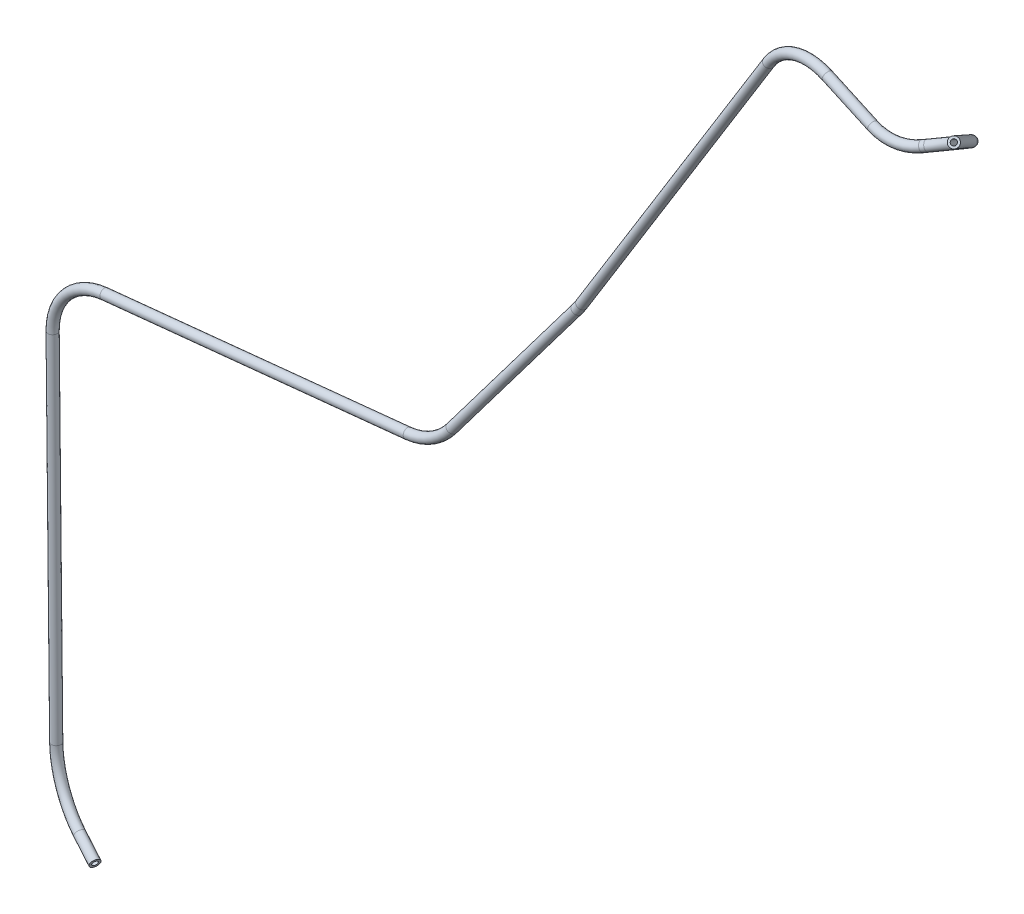
ISO-10303-21;
HEADER;
FILE_DESCRIPTION(('STEP AP214'),'2;1');
FILE_NAME('part.step','',(''),(''),'','','');
FILE_SCHEMA(('AUTOMOTIVE_DESIGN { 1 0 10303 214 1 1 1 1 }'));
ENDSEC;
DATA;
#1=APPLICATION_CONTEXT('core data for automotive mechanical design processes');
#2=APPLICATION_PROTOCOL_DEFINITION('international standard','automotive_design',2000,#1);
#3=PRODUCT_CONTEXT('',#1,'mechanical');
#4=PRODUCT('Part','Part','',(#3));
#5=PRODUCT_RELATED_PRODUCT_CATEGORY('part','',(#4));
#6=PRODUCT_DEFINITION_FORMATION('','',#4);
#7=PRODUCT_DEFINITION_CONTEXT('part definition',#1,'design');
#8=PRODUCT_DEFINITION('design','',#6,#7);
#9=PRODUCT_DEFINITION_SHAPE('','',#8);
#10=(LENGTH_UNIT() NAMED_UNIT(*) SI_UNIT(.MILLI.,.METRE.));
#11=(NAMED_UNIT(*) PLANE_ANGLE_UNIT() SI_UNIT($,.RADIAN.));
#12=(NAMED_UNIT(*) SI_UNIT($,.STERADIAN.) SOLID_ANGLE_UNIT());
#13=UNCERTAINTY_MEASURE_WITH_UNIT(LENGTH_MEASURE(1.E-05),#10,'distance_accuracy_value','');
#14=(GEOMETRIC_REPRESENTATION_CONTEXT(3) GLOBAL_UNCERTAINTY_ASSIGNED_CONTEXT((#13)) GLOBAL_UNIT_ASSIGNED_CONTEXT((#10,
#11,#12)) REPRESENTATION_CONTEXT('',''));
#15=CARTESIAN_POINT('',(0.,0.,0.));
#16=DIRECTION('',(0.,0.,1.));
#17=DIRECTION('',(1.,0.,0.));
#18=AXIS2_PLACEMENT_3D('',#15,#16,#17);
#19=CARTESIAN_POINT('',(86.4198806147665,600.1046459986,195.935969640686));
#20=DIRECTION('',(-0.495148194175255,-0.567209399702996,-0.658104674572025));
#21=DIRECTION('',(0.,0.75747952523724,-0.652858919557944));
#22=AXIS2_PLACEMENT_3D('',#19,#20,#21);
#23=CYLINDRICAL_SURFACE('',#22,3.14999999999999);
#24=CARTESIAN_POINT('',(51.9621759933296,560.632152342387,150.138011063535));
#25=DIRECTION('',(-0.495148194175255,-0.567209399702995,-0.658104674572025));
#26=DIRECTION('',(0.,0.75747952523724,-0.652858919557944));
#27=AXIS2_PLACEMENT_3D('',#24,#25,#26);
#28=CIRCLE('',#27,3.14999999999999);
#29=CARTESIAN_POINT('',(54.2526835815942,561.085770394881,148.02370132971));
#30=VERTEX_POINT('',#29);
#31=EDGE_CURVE('E56',#30,#30,#28,.T.);
#32=ORIENTED_EDGE('',*,*,#31,.F.);
#33=EDGE_LOOP('',(#32));
#34=FACE_BOUND('',#33,.T.);
#35=CARTESIAN_POINT('',(86.4198806147665,600.1046459986,195.935969640686));
#36=DIRECTION('',(-0.495148194175255,-0.567209399702995,-0.658104674572025));
#37=DIRECTION('',(0.,0.75747952523724,-0.652858919557944));
#38=AXIS2_PLACEMENT_3D('',#35,#36,#37);
#39=CIRCLE('',#38,3.14999999999999);
#40=CARTESIAN_POINT('',(86.4198806147665,602.490706503098,193.879464044079));
#41=VERTEX_POINT('',#40);
#42=EDGE_CURVE('E53',#41,#41,#39,.T.);
#43=ORIENTED_EDGE('',*,*,#42,.T.);
#44=EDGE_LOOP('',(#43));
#45=FACE_BOUND('',#44,.T.);
#46=ADVANCED_FACE('F32',(#34,#45),#23,.T.);
#47=CARTESIAN_POINT('',(15.298922646918,553.371266735064,183.980934711192));
#48=DIRECTION('',(-0.4754871478496,0.810885840511456,-0.341139452259456));
#49=DIRECTION('',(-0.862632857462139,-0.505830557822187,0.));
#50=AXIS2_PLACEMENT_3D('',#47,#48,#49);
#51=TOROIDAL_SURFACE('',#50,50.4208100566307,3.14999999999999);
#52=CARTESIAN_POINT('',(11.3195643859182,531.915361851168,138.526925644766));
#53=DIRECTION('',(-0.876175292238429,-0.401724625389253,0.266334719153863));
#54=DIRECTION('',(-0.4411502133818,0.445776665804564,-0.778890013710125));
#55=AXIS2_PLACEMENT_3D('',#52,#53,#54);
#56=CIRCLE('',#55,3.14999999999999);
#57=CARTESIAN_POINT('',(11.0709571440261,530.574921261095,135.687222585684));
#58=VERTEX_POINT('',#57);
#59=EDGE_CURVE('E59',#58,#58,#56,.T.);
#60=CARTESIAN_POINT('',(15.298922646918,553.371266735064,183.980934711192));
#61=DIRECTION('',(-0.4754871478496,0.810885840511456,-0.341139452259456));
#62=DIRECTION('',(-0.862632857462139,-0.505830557822187,0.));
#63=AXIS2_PLACEMENT_3D('',#60,#61,#62);
#64=CIRCLE('',#63,53.5708100566307);
#65=EDGE_CURVE('',#30,#58,#64,.T.);
#66=ORIENTED_EDGE('',*,*,#31,.T.);
#67=ORIENTED_EDGE('',*,*,#59,.F.);
#68=ORIENTED_EDGE('',*,*,#65,.T.);
#69=ORIENTED_EDGE('',*,*,#65,.F.);
#70=EDGE_LOOP('',(#66,#68,#67,#69));
#71=FACE_BOUND('',#70,.T.);
#72=ADVANCED_FACE('F134',(#71),#51,.T.);
#73=CARTESIAN_POINT('',(11.3195643859182,531.915361851168,138.526925644766));
#74=DIRECTION('',(-0.876175292238428,-0.401724625389253,0.266334719153868));
#75=DIRECTION('',(0.416778410130422,-0.909008117042504,0.));
#76=AXIS2_PLACEMENT_3D('',#73,#74,#75);
#77=CYLINDRICAL_SURFACE('',#76,3.14999999999999);
#78=CARTESIAN_POINT('',(8.68716130291924,530.708410283646,139.327108373064));
#79=DIRECTION('',(-0.876175292238428,-0.401724625389253,0.266334719153868));
#80=DIRECTION('',(-0.441150213381803,0.445776665804563,-0.778890013710124));
#81=AXIS2_PLACEMENT_3D('',#78,#79,#80);
#82=CIRCLE('',#81,3.14999999999999);
#83=CARTESIAN_POINT('',(10.2006608026565,528.277352051191,140.639272667162));
#84=VERTEX_POINT('',#83);
#85=EDGE_CURVE('E62',#84,#84,#82,.T.);
#86=ORIENTED_EDGE('',*,*,#85,.F.);
#87=EDGE_LOOP('',(#86));
#88=FACE_BOUND('',#87,.T.);
#89=ORIENTED_EDGE('',*,*,#59,.T.);
#90=EDGE_LOOP('',(#89));
#91=FACE_BOUND('',#90,.T.);
#92=ADVANCED_FACE('F138',(#88,#91),#77,.T.);
#93=CARTESIAN_POINT('',(-10.5318799635859,561.578991013234,122.664704638478));
#94=DIRECTION('',(-0.038205238759269,-0.492947110491665,-0.869220056136112));
#95=DIRECTION('',(0.,0.869855125748752,-0.493307267540853));
#96=AXIS2_PLACEMENT_3D('',#93,#94,#95);
#97=TOROIDAL_SURFACE('',#96,40.,3.14999999999999);
#98=CARTESIAN_POINT('',(-22.2076066135323,528.522519036459,141.924690818235));
#99=DIRECTION('',(-0.955687574068366,0.272115203614855,-0.112314632764247));
#100=DIRECTION('',(0.238883184924381,0.493890930885682,-0.836066129172363));
#101=AXIS2_PLACEMENT_3D('',#98,#99,#100);
#102=CIRCLE('',#101,3.14999999999999);
#103=CARTESIAN_POINT('',(-23.1270700872156,525.919321868288,143.441414729891));
#104=VERTEX_POINT('',#103);
#105=EDGE_CURVE('E65',#104,#104,#102,.T.);
#106=CARTESIAN_POINT('',(-10.5318799635859,561.578991013234,122.664704638478));
#107=DIRECTION('',(-0.038205238759269,-0.492947110491665,-0.869220056136112));
#108=DIRECTION('',(0.,0.869855125748752,-0.493307267540853));
#109=AXIS2_PLACEMENT_3D('',#106,#107,#108);
#110=CIRCLE('',#109,43.15);
#111=EDGE_CURVE('',#84,#104,#110,.T.);
#112=ORIENTED_EDGE('',*,*,#85,.T.);
#113=ORIENTED_EDGE('',*,*,#105,.F.);
#114=ORIENTED_EDGE('',*,*,#111,.T.);
#115=ORIENTED_EDGE('',*,*,#111,.F.);
#116=EDGE_LOOP('',(#112,#114,#113,#115));
#117=FACE_BOUND('',#116,.T.);
#118=ADVANCED_FACE('F142',(#117),#97,.T.);
#119=CARTESIAN_POINT('',(-22.2076066135324,528.522519036459,141.924690818235));
#120=DIRECTION('',(-0.955687574068366,0.272115203614856,-0.112314632764246));
#121=DIRECTION('',(-0.273847923157953,-0.961773005954147,0.));
#122=AXIS2_PLACEMENT_3D('',#119,#120,#121);
#123=CYLINDRICAL_SURFACE('',#122,3.14999999999999);
#124=CARTESIAN_POINT('',(-56.7826820290125,538.36716276938,137.861347311994));
#125=DIRECTION('',(-0.955687574068366,0.272115203614856,-0.112314632764246));
#126=DIRECTION('',(0.238883184924381,0.493890930885682,-0.836066129172363));
#127=AXIS2_PLACEMENT_3D('',#124,#125,#126);
#128=CIRCLE('',#127,3.14999999999999);
#129=CARTESIAN_POINT('',(-55.9250983391867,541.397835974271,137.906846104297));
#130=VERTEX_POINT('',#129);
#131=EDGE_CURVE('E68',#130,#130,#128,.T.);
#132=ORIENTED_EDGE('',*,*,#131,.F.);
#133=EDGE_LOOP('',(#132));
#134=FACE_BOUND('',#133,.T.);
#135=ORIENTED_EDGE('',*,*,#105,.T.);
#136=EDGE_LOOP('',(#135));
#137=FACE_BOUND('',#136,.T.);
#138=ADVANCED_FACE('F146',(#134,#137),#123,.T.);
#139=CARTESIAN_POINT('',(-67.672633645848,499.882423659654,137.283584870049));
#140=DIRECTION('',(-0.111990432116689,0.0167735132533764,0.993567708999974));
#141=DIRECTION('',(0.993707509008785,0.,0.112006189737689));
#142=AXIS2_PLACEMENT_3D('',#139,#140,#141);
#143=TOROIDAL_SURFACE('',#142,40.0000000000002,3.14999999999999);
#144=CARTESIAN_POINT('',(-101.094924943163,521.466685422019,133.151988494415));
#145=DIRECTION('',(-0.537868172406326,-0.841750216431042,-0.0464155388913315));
#146=DIRECTION('',(-0.346194687040755,0.270745030987412,-0.898246272945443));
#147=AXIS2_PLACEMENT_3D('',#144,#145,#146);
#148=CIRCLE('',#147,3.14999999999999);
#149=CARTESIAN_POINT('',(-103.726930382826,523.166446035806,132.826625279833));
#150=VERTEX_POINT('',#149);
#151=EDGE_CURVE('E71',#150,#150,#148,.T.);
#152=CARTESIAN_POINT('',(-67.672633645848,499.882423659654,137.283584870049));
#153=DIRECTION('',(-0.111990432116689,0.0167735132533764,0.993567708999974));
#154=DIRECTION('',(0.993707509008785,0.,0.112006189737689));
#155=AXIS2_PLACEMENT_3D('',#152,#153,#154);
#156=CIRCLE('',#155,43.1500000000002);
#157=EDGE_CURVE('',#130,#150,#156,.T.);
#158=ORIENTED_EDGE('',*,*,#131,.T.);
#159=ORIENTED_EDGE('',*,*,#151,.F.);
#160=ORIENTED_EDGE('',*,*,#157,.T.);
#161=ORIENTED_EDGE('',*,*,#157,.F.);
#162=EDGE_LOOP('',(#158,#160,#159,#161));
#163=FACE_BOUND('',#162,.T.);
#164=ADVANCED_FACE('F150',(#163),#143,.T.);
#165=CARTESIAN_POINT('',(-101.094924943163,521.466685422019,133.151988494415));
#166=DIRECTION('',(-0.537868172406325,-0.841750216431043,-0.0464155388913327));
#167=DIRECTION('',(0.842658418449492,-0.538448502473729,0.));
#168=AXIS2_PLACEMENT_3D('',#165,#166,#167);
#169=CYLINDRICAL_SURFACE('',#168,3.14999999999999);
#170=CARTESIAN_POINT('',(-238.849874980031,305.883639321301,121.264372589751));
#171=DIRECTION('',(-0.537868172406325,-0.841750216431043,-0.0464155388913329));
#172=DIRECTION('',(-0.346194687040755,0.270745030987413,-0.898246272945443));
#173=AXIS2_PLACEMENT_3D('',#170,#171,#172);
#174=CIRCLE('',#173,3.14999999999999);
#175=CARTESIAN_POINT('',(-237.654635223074,305.277083245481,118.413760085347));
#176=VERTEX_POINT('',#175);
#177=EDGE_CURVE('E74',#176,#176,#174,.T.);
#178=ORIENTED_EDGE('',*,*,#177,.F.);
#179=EDGE_LOOP('',(#178));
#180=FACE_BOUND('',#179,.T.);
#181=ORIENTED_EDGE('',*,*,#151,.T.);
#182=EDGE_LOOP('',(#181));
#183=FACE_BOUND('',#182,.T.);
#184=ADVANCED_FACE('F154',(#180,#183),#169,.T.);
#185=CARTESIAN_POINT('',(-254.027522687432,313.585938696807,157.462626613949));
#186=DIRECTION('',(-0.752809544576891,0.504359185843387,-0.42296524827618));
#187=DIRECTION('',(-0.556598207636051,-0.830781821693479,0.));
#188=AXIS2_PLACEMENT_3D('',#185,#186,#187);
#189=TOROIDAL_SURFACE('',#188,40.0000000000015,3.14999999999999);
#190=CARTESIAN_POINT('',(-242.134813598557,301.076171538723,121.378430680299));
#191=DIRECTION('',(-0.587264811370104,-0.804868243992137,0.0854818760875669));
#192=DIRECTION('',(-0.397881484921036,0.195102029869293,-0.896451628309031));
#193=AXIS2_PLACEMENT_3D('',#190,#191,#192);
#194=CIRCLE('',#193,3.14999999999999);
#195=CARTESIAN_POINT('',(-241.198262757809,300.091027375024,118.536800250524));
#196=VERTEX_POINT('',#195);
#197=EDGE_CURVE('E77',#196,#196,#194,.T.);
#198=CARTESIAN_POINT('',(-254.027522687432,313.585938696807,157.462626613949));
#199=DIRECTION('',(-0.752809544576891,0.504359185843387,-0.42296524827618));
#200=DIRECTION('',(-0.556598207636051,-0.830781821693479,0.));
#201=AXIS2_PLACEMENT_3D('',#198,#199,#200);
#202=CIRCLE('',#201,43.1500000000015);
#203=EDGE_CURVE('',#176,#196,#202,.T.);
#204=ORIENTED_EDGE('',*,*,#177,.T.);
#205=ORIENTED_EDGE('',*,*,#197,.F.);
#206=ORIENTED_EDGE('',*,*,#203,.T.);
#207=ORIENTED_EDGE('',*,*,#203,.F.);
#208=EDGE_LOOP('',(#204,#206,#205,#207));
#209=FACE_BOUND('',#208,.T.);
#210=ADVANCED_FACE('F158',(#209),#189,.T.);
#211=CARTESIAN_POINT('',(-242.134813598557,301.076171538723,121.3784306803));
#212=DIRECTION('',(-0.587264811370098,-0.804868243992143,0.0854818760875481));
#213=DIRECTION('',(0.807825105524544,-0.589422258558547,0.));
#214=AXIS2_PLACEMENT_3D('',#211,#212,#213);
#215=CYLINDRICAL_SURFACE('',#214,3.14999999999999);
#216=CARTESIAN_POINT('',(-315.612050210886,200.372888691609,132.07372846376));
#217=DIRECTION('',(-0.587264811370098,-0.804868243992143,0.085481876087548));
#218=DIRECTION('',(-0.397881484921029,0.195102029869304,-0.896451628309032));
#219=AXIS2_PLACEMENT_3D('',#216,#217,#218);
#220=CIRCLE('',#219,3.14999999999999);
#221=CARTESIAN_POINT('',(-313.063226978966,198.54208478203,132.346046617939));
#222=VERTEX_POINT('',#221);
#223=EDGE_CURVE('E80',#222,#222,#220,.T.);
#224=ORIENTED_EDGE('',*,*,#223,.F.);
#225=EDGE_LOOP('',(#224));
#226=FACE_BOUND('',#225,.T.);
#227=ORIENTED_EDGE('',*,*,#197,.T.);
#228=EDGE_LOOP('',(#227));
#229=FACE_BOUND('',#228,.T.);
#230=ADVANCED_FACE('F162',(#226,#229),#215,.T.);
#231=CARTESIAN_POINT('',(-347.978059505104,223.621192305315,128.615720156724));
#232=DIRECTION('',(0.0198983116259835,-0.119936844802069,-0.992582092551221));
#233=DIRECTION('',(0.,0.992778653792643,-0.119960595920776));
#234=AXIS2_PLACEMENT_3D('',#231,#232,#233);
#235=TOROIDAL_SURFACE('',#234,39.9999999999999,3.14999999999999);
#236=CARTESIAN_POINT('',(-343.742816986193,184.143470647522,133.4708425564));
#237=DIRECTION('',(-0.994179690849795,-0.107510865509328,-0.00693945957852277));
#238=DIRECTION('',(-0.0372175527726293,0.403179035910899,-0.914363996867536));
#239=AXIS2_PLACEMENT_3D('',#236,#237,#238);
#240=CIRCLE('',#239,3.14999999999999);
#241=CARTESIAN_POINT('',(-343.409291637829,181.034600066971,133.853183445375));
#242=VERTEX_POINT('',#241);
#243=EDGE_CURVE('E83',#242,#242,#240,.T.);
#244=CARTESIAN_POINT('',(-347.978059505104,223.621192305315,128.615720156724));
#245=DIRECTION('',(0.0198983116259835,-0.119936844802069,-0.992582092551221));
#246=DIRECTION('',(0.,0.992778653792643,-0.119960595920776));
#247=AXIS2_PLACEMENT_3D('',#244,#245,#246);
#248=CIRCLE('',#247,43.1499999999999);
#249=EDGE_CURVE('',#222,#242,#248,.T.);
#250=ORIENTED_EDGE('',*,*,#223,.T.);
#251=ORIENTED_EDGE('',*,*,#243,.F.);
#252=ORIENTED_EDGE('',*,*,#249,.T.);
#253=ORIENTED_EDGE('',*,*,#249,.F.);
#254=EDGE_LOOP('',(#250,#252,#251,#253));
#255=FACE_BOUND('',#254,.T.);
#256=ADVANCED_FACE('F166',(#255),#235,.T.);
#257=CARTESIAN_POINT('',(-343.742816986193,184.143470647522,133.4708425564));
#258=DIRECTION('',(-0.994179690849795,-0.107510865509328,-0.0069394595785231));
#259=DIRECTION('',(0.107513454254781,-0.994203629622325,0.));
#260=AXIS2_PLACEMENT_3D('',#257,#258,#259);
#261=CYLINDRICAL_SURFACE('',#260,3.14999999999999);
#262=CARTESIAN_POINT('',(-549.407992242278,161.902781966778,132.03528197964));
#263=DIRECTION('',(-0.994179690849795,-0.107510865509328,-0.00693945957852299));
#264=DIRECTION('',(-0.0372175527726291,0.403179035910899,-0.914363996867536));
#265=AXIS2_PLACEMENT_3D('',#262,#263,#264);
#266=CIRCLE('',#265,3.14999999999999);
#267=CARTESIAN_POINT('',(-549.746838937124,165.034379564868,132.063199734279));
#268=VERTEX_POINT('',#267);
#269=EDGE_CURVE('E86',#268,#268,#266,.T.);
#270=ORIENTED_EDGE('',*,*,#269,.F.);
#271=EDGE_LOOP('',(#270));
#272=FACE_BOUND('',#271,.T.);
#273=ORIENTED_EDGE('',*,*,#243,.T.);
#274=EDGE_LOOP('',(#273));
#275=FACE_BOUND('',#274,.T.);
#276=ADVANCED_FACE('F170',(#272,#275),#261,.T.);
#277=CARTESIAN_POINT('',(-545.10517706963,122.136463260863,131.680770809619));
#278=DIRECTION('',(-0.0059460739631173,-0.00955767543446665,0.999936645515462));
#279=DIRECTION('',(0.,-0.999954322762021,-0.00955784439855647));
#280=AXIS2_PLACEMENT_3D('',#277,#278,#279);
#281=TOROIDAL_SURFACE('',#280,40.,3.14999999999999);
#282=CARTESIAN_POINT('',(-585.1044638358,122.116625502588,131.442727408064));
#283=DIRECTION('',(0.000552791075884934,-0.999954201391184,-0.0095545560935813));
#284=DIRECTION('',(-0.391258148464033,0.00857660306402869,-0.920241002748943));
#285=AXIS2_PLACEMENT_3D('',#282,#283,#284);
#286=CIRCLE('',#285,3.14999999999999);
#287=CARTESIAN_POINT('',(-588.254407668636,122.115063279124,131.423981490191));
#288=VERTEX_POINT('',#287);
#289=EDGE_CURVE('E89',#288,#288,#286,.T.);
#290=CARTESIAN_POINT('',(-545.10517706963,122.136463260863,131.680770809619));
#291=DIRECTION('',(-0.0059460739631173,-0.00955767543446665,0.999936645515462));
#292=DIRECTION('',(0.,-0.999954322762021,-0.00955784439855647));
#293=AXIS2_PLACEMENT_3D('',#290,#291,#292);
#294=CIRCLE('',#293,43.15);
#295=EDGE_CURVE('',#268,#288,#294,.T.);
#296=ORIENTED_EDGE('',*,*,#269,.T.);
#297=ORIENTED_EDGE('',*,*,#289,.F.);
#298=ORIENTED_EDGE('',*,*,#295,.T.);
#299=ORIENTED_EDGE('',*,*,#295,.F.);
#300=EDGE_LOOP('',(#296,#298,#297,#299));
#301=FACE_BOUND('',#300,.T.);
#302=ADVANCED_FACE('F108',(#301),#281,.T.);
#303=CARTESIAN_POINT('',(-585.1044638358,122.116625502588,131.442727408064));
#304=DIRECTION('',(0.000552791075884882,-0.999954201391184,-0.00955455609358108));
#305=DIRECTION('',(0.,0.00955455755341236,-0.999954354173208));
#306=AXIS2_PLACEMENT_3D('',#303,#304,#305);
#307=CYLINDRICAL_SURFACE('',#306,3.14999999999999);
#308=CARTESIAN_POINT('',(-584.971339316517,-118.694827815781,129.14177548896));
#309=DIRECTION('',(0.000552791075884726,-0.999954201391184,-0.00955455609358113));
#310=DIRECTION('',(-0.391258148464033,0.0085766030640288,-0.920241002748943));
#311=AXIS2_PLACEMENT_3D('',#308,#309,#310);
#312=CIRCLE('',#311,3.14999999999999);
#313=CARTESIAN_POINT('',(-587.938016591414,-118.68635012907,128.082882635345));
#314=VERTEX_POINT('',#313);
#315=EDGE_CURVE('E91',#314,#314,#312,.T.);
#316=ORIENTED_EDGE('',*,*,#315,.F.);
#317=EDGE_LOOP('',(#316));
#318=FACE_BOUND('',#317,.T.);
#319=ORIENTED_EDGE('',*,*,#289,.T.);
#320=EDGE_LOOP('',(#319));
#321=FACE_BOUND('',#320,.T.);
#322=ADVANCED_FACE('F101',(#318,#321),#307,.T.);
#323=CARTESIAN_POINT('',(-547.299246936868,-118.80248098036,142.588033947556));
#324=DIRECTION('',(-0.336166780421623,-0.00918432728709734,0.941757688512944));
#325=DIRECTION('',(0.941797410535913,0.,0.336180959466547));
#326=AXIS2_PLACEMENT_3D('',#323,#324,#325);
#327=TOROIDAL_SURFACE('',#326,39.9999999999999,3.14999999999999);
#328=CARTESIAN_POINT('',(-560.966387036474,-156.027939679295,137.346421013391));
#329=DIRECTION('',(0.877637565671076,-0.36582976032705,0.309710977819645));
#330=DIRECTION('',(0.0155392965210562,-0.624085121993695,-0.781201824607282));
#331=AXIS2_PLACEMENT_3D('',#328,#329,#330);
#332=CIRCLE('',#331,3.14999999999999);
#333=CARTESIAN_POINT('',(-562.042674319318,-158.959444551836,136.933643994825));
#334=VERTEX_POINT('',#333);
#335=EDGE_CURVE('E36',#334,#334,#332,.T.);
#336=CARTESIAN_POINT('',(-547.299246936868,-118.80248098036,142.588033947556));
#337=DIRECTION('',(-0.336166780421623,-0.00918432728709734,0.941757688512944));
#338=DIRECTION('',(0.941797410535913,0.,0.336180959466547));
#339=AXIS2_PLACEMENT_3D('',#336,#337,#338);
#340=CIRCLE('',#339,43.1499999999999);
#341=EDGE_CURVE('',#314,#334,#340,.T.);
#342=ORIENTED_EDGE('',*,*,#315,.T.);
#343=ORIENTED_EDGE('',*,*,#335,.F.);
#344=ORIENTED_EDGE('',*,*,#341,.T.);
#345=ORIENTED_EDGE('',*,*,#341,.F.);
#346=EDGE_LOOP('',(#342,#344,#343,#345));
#347=FACE_BOUND('',#346,.T.);
#348=ADVANCED_FACE('F99',(#347),#327,.T.);
#349=CARTESIAN_POINT('',(-560.966387036474,-156.027939679295,137.346421013391));
#350=DIRECTION('',(0.877637565671077,-0.365829760327046,0.309710977819647));
#351=DIRECTION('',(0.384747507717856,0.923021860686354,0.));
#352=AXIS2_PLACEMENT_3D('',#349,#350,#351);
#353=CYLINDRICAL_SURFACE('',#352,3.14999999999999);
#354=CARTESIAN_POINT('',(-545.028755439978,-162.671297000342,142.970678291058));
#355=DIRECTION('',(0.877637565671077,-0.365829760327047,0.309710977819647));
#356=DIRECTION('',(0.01553929652106,-0.624085121993696,-0.781201824607281));
#357=AXIS2_PLACEMENT_3D('',#354,#355,#356);
#358=CIRCLE('',#357,3.14999999999999);
#359=CARTESIAN_POINT('',(-544.979806655937,-164.637165134622,140.509892543546));
#360=VERTEX_POINT('',#359);
#361=EDGE_CURVE('E49',#360,#360,#358,.T.);
#362=ORIENTED_EDGE('',*,*,#361,.F.);
#363=EDGE_LOOP('',(#362));
#364=FACE_BOUND('',#363,.T.);
#365=ORIENTED_EDGE('',*,*,#335,.T.);
#366=EDGE_LOOP('',(#365));
#367=FACE_BOUND('',#366,.T.);
#368=ADVANCED_FACE('F34',(#364,#367),#353,.T.);
#369=CARTESIAN_POINT('',(86.4198806147665,600.1046459986,195.935969640686));
#370=DIRECTION('',(-0.495148194175255,-0.567209399702995,-0.658104674572025));
#371=DIRECTION('',(0.,0.75747952523724,-0.652858919557944));
#372=AXIS2_PLACEMENT_3D('',#369,#370,#371);
#373=PLANE('',#372);
#374=CARTESIAN_POINT('',(86.4198806147665,600.1046459986,195.935969640686));
#375=DIRECTION('',(-0.495148194175255,-0.567209399702995,-0.658104674572025));
#376=DIRECTION('',(0.,0.75747952523724,-0.652858919557944));
#377=AXIS2_PLACEMENT_3D('',#374,#375,#376);
#378=CIRCLE('',#377,1.75000000000002);
#379=CARTESIAN_POINT('',(86.4198806147665,601.430235167766,194.79346653146));
#380=VERTEX_POINT('',#379);
#381=EDGE_CURVE('E52',#380,#380,#378,.F.);
#382=ORIENTED_EDGE('',*,*,#381,.F.);
#383=EDGE_LOOP('',(#382));
#384=FACE_BOUND('',#383,.T.);
#385=ORIENTED_EDGE('',*,*,#42,.F.);
#386=EDGE_LOOP('',(#385));
#387=FACE_BOUND('',#386,.T.);
#388=ADVANCED_FACE('F106',(#384,#387),#373,.F.);
#389=CARTESIAN_POINT('',(-545.028755439978,-162.671297000342,142.970678291058));
#390=DIRECTION('',(0.877637565671077,-0.365829760327047,0.309710977819647));
#391=DIRECTION('',(0.01553929652106,-0.624085121993696,-0.781201824607281));
#392=AXIS2_PLACEMENT_3D('',#389,#390,#391);
#393=PLANE('',#392);
#394=CARTESIAN_POINT('',(-545.028755439978,-162.671297000342,142.970678291058));
#395=DIRECTION('',(0.877637565671077,-0.365829760327047,0.309710977819647));
#396=DIRECTION('',(0.01553929652106,-0.624085121993696,-0.781201824607281));
#397=AXIS2_PLACEMENT_3D('',#394,#395,#396);
#398=CIRCLE('',#397,1.75000000000002);
#399=CARTESIAN_POINT('',(-545.001561671066,-163.763445963831,141.603575097996));
#400=VERTEX_POINT('',#399);
#401=EDGE_CURVE('E10',#400,#400,#398,.F.);
#402=ORIENTED_EDGE('',*,*,#401,.T.);
#403=EDGE_LOOP('',(#402));
#404=FACE_BOUND('',#403,.T.);
#405=ORIENTED_EDGE('',*,*,#361,.T.);
#406=EDGE_LOOP('',(#405));
#407=FACE_BOUND('',#406,.T.);
#408=ADVANCED_FACE('F125',(#404,#407),#393,.T.);
#409=CARTESIAN_POINT('',(86.4198806147665,600.1046459986,195.935969640686));
#410=DIRECTION('',(-0.495148194175255,-0.567209399702996,-0.658104674572025));
#411=DIRECTION('',(0.,0.75747952523724,-0.652858919557944));
#412=AXIS2_PLACEMENT_3D('',#409,#410,#411);
#413=CYLINDRICAL_SURFACE('',#412,1.75000000000002);
#414=CARTESIAN_POINT('',(51.9621759933296,560.632152342387,150.138011063535));
#415=DIRECTION('',(-0.495148194175255,-0.567209399702995,-0.658104674572025));
#416=DIRECTION('',(0.,0.75747952523724,-0.652858919557944));
#417=AXIS2_PLACEMENT_3D('',#414,#415,#416);
#418=CIRCLE('',#417,1.75000000000002);
#419=CARTESIAN_POINT('',(53.2346802090319,560.88416237155,148.963394544743));
#420=VERTEX_POINT('',#419);
#421=EDGE_CURVE('E413',#420,#420,#418,.F.);
#422=ORIENTED_EDGE('',*,*,#421,.F.);
#423=EDGE_LOOP('',(#422));
#424=FACE_BOUND('',#423,.T.);
#425=ORIENTED_EDGE('',*,*,#381,.T.);
#426=EDGE_LOOP('',(#425));
#427=FACE_BOUND('',#426,.T.);
#428=ADVANCED_FACE('F128',(#424,#427),#413,.F.);
#429=CARTESIAN_POINT('',(15.298922646918,553.371266735064,183.980934711192));
#430=DIRECTION('',(-0.4754871478496,0.810885840511456,-0.341139452259456));
#431=DIRECTION('',(-0.862632857462139,-0.505830557822187,0.));
#432=AXIS2_PLACEMENT_3D('',#429,#430,#431);
#433=TOROIDAL_SURFACE('',#432,50.4208100566307,1.75000000000002);
#434=CARTESIAN_POINT('',(11.3195643859182,531.915361851168,138.526925644766));
#435=DIRECTION('',(-0.876175292238429,-0.401724625389253,0.266334719153863));
#436=DIRECTION('',(-0.4411502133818,0.445776665804564,-0.778890013710125));
#437=AXIS2_PLACEMENT_3D('',#434,#435,#436);
#438=CIRCLE('',#437,1.75000000000002);
#439=CARTESIAN_POINT('',(11.1814492515338,531.170672634461,136.949312834165));
#440=VERTEX_POINT('',#439);
#441=EDGE_CURVE('E410',#440,#440,#438,.F.);
#442=CARTESIAN_POINT('',(15.298922646918,553.371266735064,183.980934711192));
#443=DIRECTION('',(-0.4754871478496,0.810885840511456,-0.341139452259456));
#444=DIRECTION('',(-0.862632857462139,-0.505830557822187,0.));
#445=AXIS2_PLACEMENT_3D('',#442,#443,#444);
#446=CIRCLE('',#445,52.1708100566308);
#447=EDGE_CURVE('',#420,#440,#446,.T.);
#448=ORIENTED_EDGE('',*,*,#421,.T.);
#449=ORIENTED_EDGE('',*,*,#441,.F.);
#450=ORIENTED_EDGE('',*,*,#447,.T.);
#451=ORIENTED_EDGE('',*,*,#447,.F.);
#452=EDGE_LOOP('',(#448,#450,#449,#451));
#453=FACE_BOUND('',#452,.T.);
#454=ADVANCED_FACE('F243',(#453),#433,.F.);
#455=CARTESIAN_POINT('',(11.3195643859182,531.915361851168,138.526925644766));
#456=DIRECTION('',(-0.876175292238428,-0.401724625389253,0.266334719153868));
#457=DIRECTION('',(0.416778410130422,-0.909008117042504,0.));
#458=AXIS2_PLACEMENT_3D('',#455,#456,#457);
#459=CYLINDRICAL_SURFACE('',#458,1.75000000000002);
#460=CARTESIAN_POINT('',(8.68716130291924,530.708410283646,139.327108373064));
#461=DIRECTION('',(-0.876175292238428,-0.401724625389253,0.266334719153868));
#462=DIRECTION('',(-0.441150213381803,0.445776665804563,-0.778890013710124));
#463=AXIS2_PLACEMENT_3D('',#460,#461,#462);
#464=CIRCLE('',#463,1.75000000000002);
#465=CARTESIAN_POINT('',(9.52799435832885,529.357822376726,140.056088536452));
#466=VERTEX_POINT('',#465);
#467=EDGE_CURVE('E407',#466,#466,#464,.F.);
#468=ORIENTED_EDGE('',*,*,#467,.F.);
#469=EDGE_LOOP('',(#468));
#470=FACE_BOUND('',#469,.T.);
#471=ORIENTED_EDGE('',*,*,#441,.T.);
#472=EDGE_LOOP('',(#471));
#473=FACE_BOUND('',#472,.T.);
#474=ADVANCED_FACE('F253',(#470,#473),#459,.F.);
#475=CARTESIAN_POINT('',(-10.5318799635859,561.578991013234,122.664704638478));
#476=DIRECTION('',(-0.038205238759269,-0.492947110491665,-0.869220056136112));
#477=DIRECTION('',(0.,0.869855125748752,-0.493307267540853));
#478=AXIS2_PLACEMENT_3D('',#475,#476,#477);
#479=TOROIDAL_SURFACE('',#478,40.,1.75000000000002);
#480=CARTESIAN_POINT('',(-22.2076066135323,528.522519036459,141.924690818235));
#481=DIRECTION('',(-0.955687574068366,0.272115203614855,-0.112314632764247));
#482=DIRECTION('',(0.238883184924381,0.493890930885682,-0.836066129172363));
#483=AXIS2_PLACEMENT_3D('',#480,#481,#482);
#484=CIRCLE('',#483,1.75000000000002);
#485=CARTESIAN_POINT('',(-22.7184196544675,527.076298387475,142.767315213599));
#486=VERTEX_POINT('',#485);
#487=EDGE_CURVE('E404',#486,#486,#484,.F.);
#488=CARTESIAN_POINT('',(-10.5318799635859,561.578991013234,122.664704638478));
#489=DIRECTION('',(-0.038205238759269,-0.492947110491665,-0.869220056136112));
#490=DIRECTION('',(0.,0.869855125748752,-0.493307267540853));
#491=AXIS2_PLACEMENT_3D('',#488,#489,#490);
#492=CIRCLE('',#491,41.75);
#493=EDGE_CURVE('',#466,#486,#492,.T.);
#494=ORIENTED_EDGE('',*,*,#467,.T.);
#495=ORIENTED_EDGE('',*,*,#487,.F.);
#496=ORIENTED_EDGE('',*,*,#493,.T.);
#497=ORIENTED_EDGE('',*,*,#493,.F.);
#498=EDGE_LOOP('',(#494,#496,#495,#497));
#499=FACE_BOUND('',#498,.T.);
#500=ADVANCED_FACE('F263',(#499),#479,.F.);
#501=CARTESIAN_POINT('',(-22.2076066135324,528.522519036459,141.924690818235));
#502=DIRECTION('',(-0.955687574068366,0.272115203614856,-0.112314632764246));
#503=DIRECTION('',(-0.273847923157953,-0.961773005954147,0.));
#504=AXIS2_PLACEMENT_3D('',#501,#502,#503);
#505=CYLINDRICAL_SURFACE('',#504,1.75000000000002);
#506=CARTESIAN_POINT('',(-56.7826820290125,538.36716276938,137.861347311994));
#507=DIRECTION('',(-0.955687574068366,0.272115203614856,-0.112314632764246));
#508=DIRECTION('',(0.238883184924381,0.493890930885682,-0.836066129172363));
#509=AXIS2_PLACEMENT_3D('',#506,#507,#508);
#510=CIRCLE('',#509,1.75000000000002);
#511=CARTESIAN_POINT('',(-56.3062466457759,540.050870105431,137.886624418829));
#512=VERTEX_POINT('',#511);
#513=EDGE_CURVE('E401',#512,#512,#510,.F.);
#514=ORIENTED_EDGE('',*,*,#513,.F.);
#515=EDGE_LOOP('',(#514));
#516=FACE_BOUND('',#515,.T.);
#517=ORIENTED_EDGE('',*,*,#487,.T.);
#518=EDGE_LOOP('',(#517));
#519=FACE_BOUND('',#518,.T.);
#520=ADVANCED_FACE('F273',(#516,#519),#505,.F.);
#521=CARTESIAN_POINT('',(-67.672633645848,499.882423659654,137.283584870049));
#522=DIRECTION('',(-0.111990432116689,0.0167735132533764,0.993567708999974));
#523=DIRECTION('',(0.993707509008785,0.,0.112006189737689));
#524=AXIS2_PLACEMENT_3D('',#521,#522,#523);
#525=TOROIDAL_SURFACE('',#524,40.0000000000002,1.75000000000002);
#526=CARTESIAN_POINT('',(-101.094924943163,521.466685422019,133.151988494415));
#527=DIRECTION('',(-0.537868172406326,-0.841750216431042,-0.0464155388913315));
#528=DIRECTION('',(-0.346194687040755,0.270745030987412,-0.898246272945443));
#529=AXIS2_PLACEMENT_3D('',#526,#527,#528);
#530=CIRCLE('',#529,1.75000000000002);
#531=CARTESIAN_POINT('',(-102.55715018742,522.410996874123,132.971231152981));
#532=VERTEX_POINT('',#531);
#533=EDGE_CURVE('E398',#532,#532,#530,.F.);
#534=CARTESIAN_POINT('',(-67.672633645848,499.882423659654,137.283584870049));
#535=DIRECTION('',(-0.111990432116689,0.0167735132533764,0.993567708999974));
#536=DIRECTION('',(0.993707509008785,0.,0.112006189737689));
#537=AXIS2_PLACEMENT_3D('',#534,#535,#536);
#538=CIRCLE('',#537,41.7500000000002);
#539=EDGE_CURVE('',#512,#532,#538,.T.);
#540=ORIENTED_EDGE('',*,*,#513,.T.);
#541=ORIENTED_EDGE('',*,*,#533,.F.);
#542=ORIENTED_EDGE('',*,*,#539,.T.);
#543=ORIENTED_EDGE('',*,*,#539,.F.);
#544=EDGE_LOOP('',(#540,#542,#541,#543));
#545=FACE_BOUND('',#544,.T.);
#546=ADVANCED_FACE('F283',(#545),#525,.F.);
#547=CARTESIAN_POINT('',(-101.094924943163,521.466685422019,133.151988494415));
#548=DIRECTION('',(-0.537868172406325,-0.841750216431043,-0.0464155388913327));
#549=DIRECTION('',(0.842658418449492,-0.538448502473729,0.));
#550=AXIS2_PLACEMENT_3D('',#547,#548,#549);
#551=CYLINDRICAL_SURFACE('',#550,1.75000000000002);
#552=CARTESIAN_POINT('',(-238.849874980031,305.883639321301,121.264372589751));
#553=DIRECTION('',(-0.537868172406325,-0.841750216431043,-0.0464155388913329));
#554=DIRECTION('',(-0.346194687040755,0.270745030987413,-0.898246272945443));
#555=AXIS2_PLACEMENT_3D('',#552,#553,#554);
#556=CIRCLE('',#555,1.75000000000002);
#557=CARTESIAN_POINT('',(-238.185852892833,305.546663723623,119.680698976194));
#558=VERTEX_POINT('',#557);
#559=EDGE_CURVE('E395',#558,#558,#556,.F.);
#560=ORIENTED_EDGE('',*,*,#559,.F.);
#561=EDGE_LOOP('',(#560));
#562=FACE_BOUND('',#561,.T.);
#563=ORIENTED_EDGE('',*,*,#533,.T.);
#564=EDGE_LOOP('',(#563));
#565=FACE_BOUND('',#564,.T.);
#566=ADVANCED_FACE('F293',(#562,#565),#551,.F.);
#567=CARTESIAN_POINT('',(-254.027522687432,313.585938696807,157.462626613949));
#568=DIRECTION('',(-0.752809544576891,0.504359185843387,-0.42296524827618));
#569=DIRECTION('',(-0.556598207636051,-0.830781821693479,0.));
#570=AXIS2_PLACEMENT_3D('',#567,#568,#569);
#571=TOROIDAL_SURFACE('',#570,40.0000000000015,1.75000000000002);
#572=CARTESIAN_POINT('',(-242.134813598557,301.076171538723,121.378430680299));
#573=DIRECTION('',(-0.587264811370104,-0.804868243992137,0.0854818760875669));
#574=DIRECTION('',(-0.397881484921036,0.195102029869293,-0.896451628309031));
#575=AXIS2_PLACEMENT_3D('',#572,#573,#574);
#576=CIRCLE('',#575,1.75000000000002);
#577=CARTESIAN_POINT('',(-241.614507575919,300.528869225557,119.799747108201));
#578=VERTEX_POINT('',#577);
#579=EDGE_CURVE('E392',#578,#578,#576,.F.);
#580=CARTESIAN_POINT('',(-254.027522687432,313.585938696807,157.462626613949));
#581=DIRECTION('',(-0.752809544576891,0.504359185843387,-0.42296524827618));
#582=DIRECTION('',(-0.556598207636051,-0.830781821693479,0.));
#583=AXIS2_PLACEMENT_3D('',#580,#581,#582);
#584=CIRCLE('',#583,41.7500000000015);
#585=EDGE_CURVE('',#558,#578,#584,.T.);
#586=ORIENTED_EDGE('',*,*,#559,.T.);
#587=ORIENTED_EDGE('',*,*,#579,.F.);
#588=ORIENTED_EDGE('',*,*,#585,.T.);
#589=ORIENTED_EDGE('',*,*,#585,.F.);
#590=EDGE_LOOP('',(#586,#588,#587,#589));
#591=FACE_BOUND('',#590,.T.);
#592=ADVANCED_FACE('F303',(#591),#571,.F.);
#593=CARTESIAN_POINT('',(-242.134813598557,301.076171538723,121.3784306803));
#594=DIRECTION('',(-0.587264811370098,-0.804868243992143,0.0854818760875481));
#595=DIRECTION('',(0.807825105524544,-0.589422258558547,0.));
#596=AXIS2_PLACEMENT_3D('',#593,#594,#595);
#597=CYLINDRICAL_SURFACE('',#596,1.75000000000002);
#598=CARTESIAN_POINT('',(-315.612050210886,200.372888691609,132.07372846376));
#599=DIRECTION('',(-0.587264811370098,-0.804868243992143,0.085481876087548));
#600=DIRECTION('',(-0.397881484921029,0.195102029869304,-0.896451628309032));
#601=AXIS2_PLACEMENT_3D('',#598,#599,#600);
#602=CIRCLE('',#601,1.75000000000002);
#603=CARTESIAN_POINT('',(-314.196037304264,199.35577540851,132.225016327193));
#604=VERTEX_POINT('',#603);
#605=EDGE_CURVE('E389',#604,#604,#602,.F.);
#606=ORIENTED_EDGE('',*,*,#605,.F.);
#607=EDGE_LOOP('',(#606));
#608=FACE_BOUND('',#607,.T.);
#609=ORIENTED_EDGE('',*,*,#579,.T.);
#610=EDGE_LOOP('',(#609));
#611=FACE_BOUND('',#610,.T.);
#612=ADVANCED_FACE('F313',(#608,#611),#597,.F.);
#613=CARTESIAN_POINT('',(-347.978059505104,223.621192305315,128.615720156724));
#614=DIRECTION('',(0.0198983116259835,-0.119936844802069,-0.992582092551221));
#615=DIRECTION('',(0.,0.992778653792643,-0.119960595920776));
#616=AXIS2_PLACEMENT_3D('',#613,#614,#615);
#617=TOROIDAL_SURFACE('',#616,39.9999999999999,1.75000000000002);
#618=CARTESIAN_POINT('',(-343.742816986193,184.143470647522,133.4708425564));
#619=DIRECTION('',(-0.994179690849795,-0.107510865509328,-0.00693945957852277));
#620=DIRECTION('',(-0.0372175527726293,0.403179035910899,-0.914363996867536));
#621=AXIS2_PLACEMENT_3D('',#618,#619,#620);
#622=CIRCLE('',#621,1.75000000000002);
#623=CARTESIAN_POINT('',(-343.557525125991,182.416320324994,133.683254161386));
#624=VERTEX_POINT('',#623);
#625=EDGE_CURVE('E384',#624,#624,#622,.F.);
#626=CARTESIAN_POINT('',(-347.978059505104,223.621192305315,128.615720156724));
#627=DIRECTION('',(0.0198983116259835,-0.119936844802069,-0.992582092551221));
#628=DIRECTION('',(0.,0.992778653792643,-0.119960595920776));
#629=AXIS2_PLACEMENT_3D('',#626,#627,#628);
#630=CIRCLE('',#629,41.75);
#631=EDGE_CURVE('',#604,#624,#630,.T.);
#632=ORIENTED_EDGE('',*,*,#605,.T.);
#633=ORIENTED_EDGE('',*,*,#625,.F.);
#634=ORIENTED_EDGE('',*,*,#631,.T.);
#635=ORIENTED_EDGE('',*,*,#631,.F.);
#636=EDGE_LOOP('',(#632,#634,#633,#635));
#637=FACE_BOUND('',#636,.T.);
#638=ADVANCED_FACE('F323',(#637),#617,.F.);
#639=CARTESIAN_POINT('',(-343.742816986193,184.143470647522,133.4708425564));
#640=DIRECTION('',(-0.994179690849795,-0.107510865509328,-0.0069394595785231));
#641=DIRECTION('',(0.107513454254781,-0.994203629622325,0.));
#642=AXIS2_PLACEMENT_3D('',#639,#640,#641);
#643=CYLINDRICAL_SURFACE('',#642,1.75000000000002);
#644=CARTESIAN_POINT('',(-549.407992242278,161.902781966778,132.03528197964));
#645=DIRECTION('',(-0.994179690849795,-0.107510865509328,-0.00693945957852299));
#646=DIRECTION('',(-0.0372175527726291,0.403179035910899,-0.914363996867536));
#647=AXIS2_PLACEMENT_3D('',#644,#645,#646);
#648=CIRCLE('',#647,1.75000000000002);
#649=CARTESIAN_POINT('',(-549.596240406081,163.642558410161,132.050791843329));
#650=VERTEX_POINT('',#649);
#651=EDGE_CURVE('E381',#650,#650,#648,.F.);
#652=ORIENTED_EDGE('',*,*,#651,.F.);
#653=EDGE_LOOP('',(#652));
#654=FACE_BOUND('',#653,.T.);
#655=ORIENTED_EDGE('',*,*,#625,.T.);
#656=EDGE_LOOP('',(#655));
#657=FACE_BOUND('',#656,.T.);
#658=ADVANCED_FACE('F333',(#654,#657),#643,.F.);
#659=CARTESIAN_POINT('',(-545.10517706963,122.136463260863,131.680770809619));
#660=DIRECTION('',(-0.0059460739631173,-0.00955767543446665,0.999936645515462));
#661=DIRECTION('',(0.,-0.999954322762021,-0.00955784439855647));
#662=AXIS2_PLACEMENT_3D('',#659,#660,#661);
#663=TOROIDAL_SURFACE('',#662,40.,1.75000000000002);
#664=CARTESIAN_POINT('',(-585.1044638358,122.116625502588,131.442727408064));
#665=DIRECTION('',(0.000552791075884934,-0.999954201391184,-0.0095545560935813));
#666=DIRECTION('',(-0.391258148464033,0.00857660306402869,-0.920241002748943));
#667=AXIS2_PLACEMENT_3D('',#664,#665,#666);
#668=CIRCLE('',#667,1.75000000000002);
#669=CARTESIAN_POINT('',(-586.85443263182,122.115757600663,131.432313009246));
#670=VERTEX_POINT('',#669);
#671=EDGE_CURVE('E380',#670,#670,#668,.F.);
#672=CARTESIAN_POINT('',(-545.10517706963,122.136463260863,131.680770809619));
#673=DIRECTION('',(-0.0059460739631173,-0.00955767543446665,0.999936645515462));
#674=DIRECTION('',(0.,-0.999954322762021,-0.00955784439855647));
#675=AXIS2_PLACEMENT_3D('',#672,#673,#674);
#676=CIRCLE('',#675,41.75);
#677=EDGE_CURVE('',#650,#670,#676,.T.);
#678=ORIENTED_EDGE('',*,*,#651,.T.);
#679=ORIENTED_EDGE('',*,*,#671,.F.);
#680=ORIENTED_EDGE('',*,*,#677,.T.);
#681=ORIENTED_EDGE('',*,*,#677,.F.);
#682=EDGE_LOOP('',(#678,#680,#679,#681));
#683=FACE_BOUND('',#682,.T.);
#684=ADVANCED_FACE('F343',(#683),#663,.F.);
#685=CARTESIAN_POINT('',(-585.1044638358,122.116625502588,131.442727408064));
#686=DIRECTION('',(0.000552791075884882,-0.999954201391184,-0.00955455609358108));
#687=DIRECTION('',(0.,0.00955455755341236,-0.999954354173208));
#688=AXIS2_PLACEMENT_3D('',#685,#686,#687);
#689=CYLINDRICAL_SURFACE('',#688,1.75000000000002);
#690=CARTESIAN_POINT('',(-584.971339316517,-118.694827815781,129.14177548896));
#691=DIRECTION('',(0.000552791075884726,-0.999954201391184,-0.00955455609358113));
#692=DIRECTION('',(-0.391258148464033,0.0085766030640288,-0.920241002748943));
#693=AXIS2_PLACEMENT_3D('',#690,#691,#692);
#694=CIRCLE('',#693,1.75000000000002);
#695=CARTESIAN_POINT('',(-586.619493358127,-118.69011798983,128.553501681396));
#696=VERTEX_POINT('',#695);
#697=EDGE_CURVE('E45',#696,#696,#694,.F.);
#698=ORIENTED_EDGE('',*,*,#697,.F.);
#699=EDGE_LOOP('',(#698));
#700=FACE_BOUND('',#699,.T.);
#701=ORIENTED_EDGE('',*,*,#671,.T.);
#702=EDGE_LOOP('',(#701));
#703=FACE_BOUND('',#702,.T.);
#704=ADVANCED_FACE('F119',(#700,#703),#689,.F.);
#705=CARTESIAN_POINT('',(-547.299246936868,-118.80248098036,142.588033947556));
#706=DIRECTION('',(-0.336166780421623,-0.00918432728709734,0.941757688512944));
#707=DIRECTION('',(0.941797410535913,0.,0.336180959466547));
#708=AXIS2_PLACEMENT_3D('',#705,#706,#707);
#709=TOROIDAL_SURFACE('',#708,39.9999999999999,1.75000000000002);
#710=CARTESIAN_POINT('',(-560.966387036474,-156.027939679295,137.346421013391));
#711=DIRECTION('',(0.877637565671076,-0.36582976032705,0.309710977819645));
#712=DIRECTION('',(0.0155392965210562,-0.624085121993695,-0.781201824607282));
#713=AXIS2_PLACEMENT_3D('',#710,#711,#712);
#714=CIRCLE('',#713,1.75000000000002);
#715=CARTESIAN_POINT('',(-561.564324415832,-157.656553497374,137.117100447521));
#716=VERTEX_POINT('',#715);
#717=EDGE_CURVE('E40',#716,#716,#714,.F.);
#718=CARTESIAN_POINT('',(-547.299246936868,-118.80248098036,142.588033947556));
#719=DIRECTION('',(-0.336166780421623,-0.00918432728709734,0.941757688512944));
#720=DIRECTION('',(0.941797410535913,0.,0.336180959466547));
#721=AXIS2_PLACEMENT_3D('',#718,#719,#720);
#722=CIRCLE('',#721,41.7499999999999);
#723=EDGE_CURVE('',#696,#716,#722,.T.);
#724=ORIENTED_EDGE('',*,*,#697,.T.);
#725=ORIENTED_EDGE('',*,*,#717,.F.);
#726=ORIENTED_EDGE('',*,*,#723,.T.);
#727=ORIENTED_EDGE('',*,*,#723,.F.);
#728=EDGE_LOOP('',(#724,#726,#725,#727));
#729=FACE_BOUND('',#728,.T.);
#730=ADVANCED_FACE('F113',(#729),#709,.F.);
#731=CARTESIAN_POINT('',(-560.966387036474,-156.027939679295,137.346421013391));
#732=DIRECTION('',(0.877637565671077,-0.365829760327046,0.309710977819647));
#733=DIRECTION('',(0.384747507717856,0.923021860686354,0.));
#734=AXIS2_PLACEMENT_3D('',#731,#732,#733);
#735=CYLINDRICAL_SURFACE('',#734,1.75000000000002);
#736=ORIENTED_EDGE('',*,*,#401,.F.);
#737=EDGE_LOOP('',(#736));
#738=FACE_BOUND('',#737,.T.);
#739=ORIENTED_EDGE('',*,*,#717,.T.);
#740=EDGE_LOOP('',(#739));
#741=FACE_BOUND('',#740,.T.);
#742=ADVANCED_FACE('F111',(#738,#741),#735,.F.);
#743=CLOSED_SHELL('',(#46,#72,#92,#118,#138,#164,#184,#210,#230,#256,#276,#302,#322,#348,#368,
#388,#408,#428,#454,#474,#500,#520,#546,#566,#592,#612,#638,#658,#684,#704,#730,#742));
#744=MANIFOLD_SOLID_BREP('B2',#743);
#745=ADVANCED_BREP_SHAPE_REPRESENTATION('',(#18,#744),#14);
#746=SHAPE_DEFINITION_REPRESENTATION(#9,#745);
ENDSEC;
END-ISO-10303-21;
